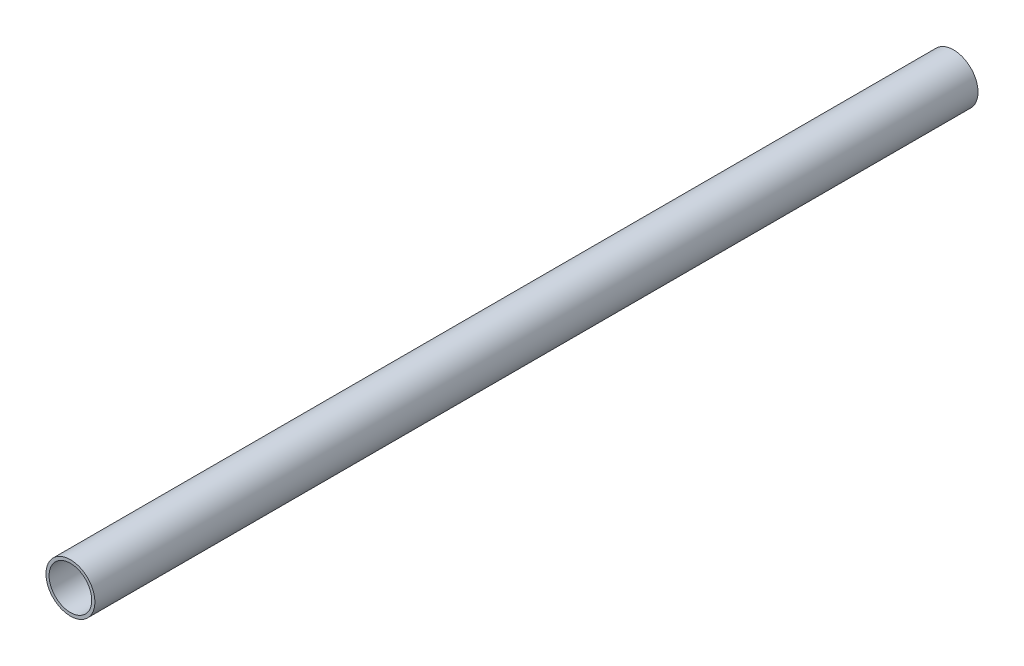
ISO-10303-21;
HEADER;
FILE_DESCRIPTION(('STEP AP214'),'2;1');
FILE_NAME('part.step','',(''),(''),'','','');
FILE_SCHEMA(('AUTOMOTIVE_DESIGN { 1 0 10303 214 1 1 1 1 }'));
ENDSEC;
DATA;
#1=APPLICATION_CONTEXT('core data for automotive mechanical design processes');
#2=APPLICATION_PROTOCOL_DEFINITION('international standard','automotive_design',2000,#1);
#3=PRODUCT_CONTEXT('',#1,'mechanical');
#4=PRODUCT('Part','Part','',(#3));
#5=PRODUCT_RELATED_PRODUCT_CATEGORY('part','',(#4));
#6=PRODUCT_DEFINITION_FORMATION('','',#4);
#7=PRODUCT_DEFINITION_CONTEXT('part definition',#1,'design');
#8=PRODUCT_DEFINITION('design','',#6,#7);
#9=PRODUCT_DEFINITION_SHAPE('','',#8);
#10=(LENGTH_UNIT() NAMED_UNIT(*) SI_UNIT(.MILLI.,.METRE.));
#11=(NAMED_UNIT(*) PLANE_ANGLE_UNIT() SI_UNIT($,.RADIAN.));
#12=(NAMED_UNIT(*) SI_UNIT($,.STERADIAN.) SOLID_ANGLE_UNIT());
#13=UNCERTAINTY_MEASURE_WITH_UNIT(LENGTH_MEASURE(1.E-05),#10,'distance_accuracy_value','');
#14=(GEOMETRIC_REPRESENTATION_CONTEXT(3) GLOBAL_UNCERTAINTY_ASSIGNED_CONTEXT((#13)) GLOBAL_UNIT_ASSIGNED_CONTEXT((#10,
#11,#12)) REPRESENTATION_CONTEXT('',''));
#15=CARTESIAN_POINT('',(0.,0.,0.));
#16=DIRECTION('',(0.,0.,1.));
#17=DIRECTION('',(1.,0.,0.));
#18=AXIS2_PLACEMENT_3D('',#15,#16,#17);
#19=CARTESIAN_POINT('',(-143.,40.45,-284.7));
#20=DIRECTION('',(0.,0.,1.));
#21=DIRECTION('',(-1.,0.,0.));
#22=AXIS2_PLACEMENT_3D('',#19,#20,#21);
#23=CYLINDRICAL_SURFACE('',#22,7.75);
#24=CARTESIAN_POINT('',(-143.,40.45,-284.7));
#25=DIRECTION('',(0.,0.,1.));
#26=DIRECTION('',(1.,0.,0.));
#27=AXIS2_PLACEMENT_3D('',#24,#25,#26);
#28=CIRCLE('',#27,7.75);
#29=CARTESIAN_POINT('',(-135.25,40.45,-284.7));
#30=VERTEX_POINT('',#29);
#31=EDGE_CURVE('E10',#30,#30,#28,.T.);
#32=ORIENTED_EDGE('',*,*,#31,.T.);
#33=EDGE_LOOP('',(#32));
#34=FACE_BOUND('',#33,.T.);
#35=CARTESIAN_POINT('',(-143.,40.45,-5.));
#36=DIRECTION('',(0.,0.,1.));
#37=DIRECTION('',(1.,0.,0.));
#38=AXIS2_PLACEMENT_3D('',#35,#36,#37);
#39=CIRCLE('',#38,7.75);
#40=CARTESIAN_POINT('',(-135.25,40.45,-5.));
#41=VERTEX_POINT('',#40);
#42=EDGE_CURVE('E38',#41,#41,#39,.T.);
#43=ORIENTED_EDGE('',*,*,#42,.F.);
#44=EDGE_LOOP('',(#43));
#45=FACE_BOUND('',#44,.T.);
#46=ADVANCED_FACE('F31',(#34,#45),#23,.T.);
#47=CARTESIAN_POINT('',(-143.,40.45,-284.7));
#48=DIRECTION('',(0.,0.,-1.));
#49=DIRECTION('',(1.,0.,0.));
#50=AXIS2_PLACEMENT_3D('',#47,#48,#49);
#51=PLANE('',#50);
#52=CARTESIAN_POINT('',(-143.,40.45,-284.7));
#53=DIRECTION('',(0.,0.,1.));
#54=DIRECTION('',(1.,0.,0.));
#55=AXIS2_PLACEMENT_3D('',#52,#53,#54);
#56=CIRCLE('',#55,6.75000000000001);
#57=CARTESIAN_POINT('',(-136.25,40.45,-284.7));
#58=VERTEX_POINT('',#57);
#59=EDGE_CURVE('E44',#58,#58,#56,.T.);
#60=ORIENTED_EDGE('',*,*,#59,.T.);
#61=EDGE_LOOP('',(#60));
#62=FACE_BOUND('',#61,.T.);
#63=ORIENTED_EDGE('',*,*,#31,.F.);
#64=EDGE_LOOP('',(#63));
#65=FACE_BOUND('',#64,.T.);
#66=ADVANCED_FACE('F61',(#62,#65),#51,.T.);
#67=CARTESIAN_POINT('',(-143.,40.45,-5.));
#68=DIRECTION('',(0.,0.,-1.));
#69=DIRECTION('',(1.,0.,0.));
#70=AXIS2_PLACEMENT_3D('',#67,#68,#69);
#71=PLANE('',#70);
#72=CARTESIAN_POINT('',(-143.,40.45,-5.));
#73=DIRECTION('',(0.,0.,-1.));
#74=DIRECTION('',(-1.,0.,0.));
#75=AXIS2_PLACEMENT_3D('',#72,#73,#74);
#76=CIRCLE('',#75,6.75000000000001);
#77=CARTESIAN_POINT('',(-149.75,40.45,-5.));
#78=VERTEX_POINT('',#77);
#79=EDGE_CURVE('E34',#78,#78,#76,.T.);
#80=ORIENTED_EDGE('',*,*,#79,.T.);
#81=EDGE_LOOP('',(#80));
#82=FACE_BOUND('',#81,.T.);
#83=ORIENTED_EDGE('',*,*,#42,.T.);
#84=EDGE_LOOP('',(#83));
#85=FACE_BOUND('',#84,.T.);
#86=ADVANCED_FACE('F51',(#82,#85),#71,.F.);
#87=CARTESIAN_POINT('',(-143.,40.45,-284.7));
#88=DIRECTION('',(0.,0.,1.));
#89=DIRECTION('',(1.,0.,0.));
#90=AXIS2_PLACEMENT_3D('',#87,#88,#89);
#91=CYLINDRICAL_SURFACE('',#90,6.75000000000001);
#92=ORIENTED_EDGE('',*,*,#59,.F.);
#93=EDGE_LOOP('',(#92));
#94=FACE_BOUND('',#93,.T.);
#95=ORIENTED_EDGE('',*,*,#79,.F.);
#96=EDGE_LOOP('',(#95));
#97=FACE_BOUND('',#96,.T.);
#98=ADVANCED_FACE('F54',(#94,#97),#91,.F.);
#99=CLOSED_SHELL('',(#46,#66,#86,#98));
#100=MANIFOLD_SOLID_BREP('B2',#99);
#101=ADVANCED_BREP_SHAPE_REPRESENTATION('',(#18,#100),#14);
#102=SHAPE_DEFINITION_REPRESENTATION(#9,#101);
ENDSEC;
END-ISO-10303-21;
